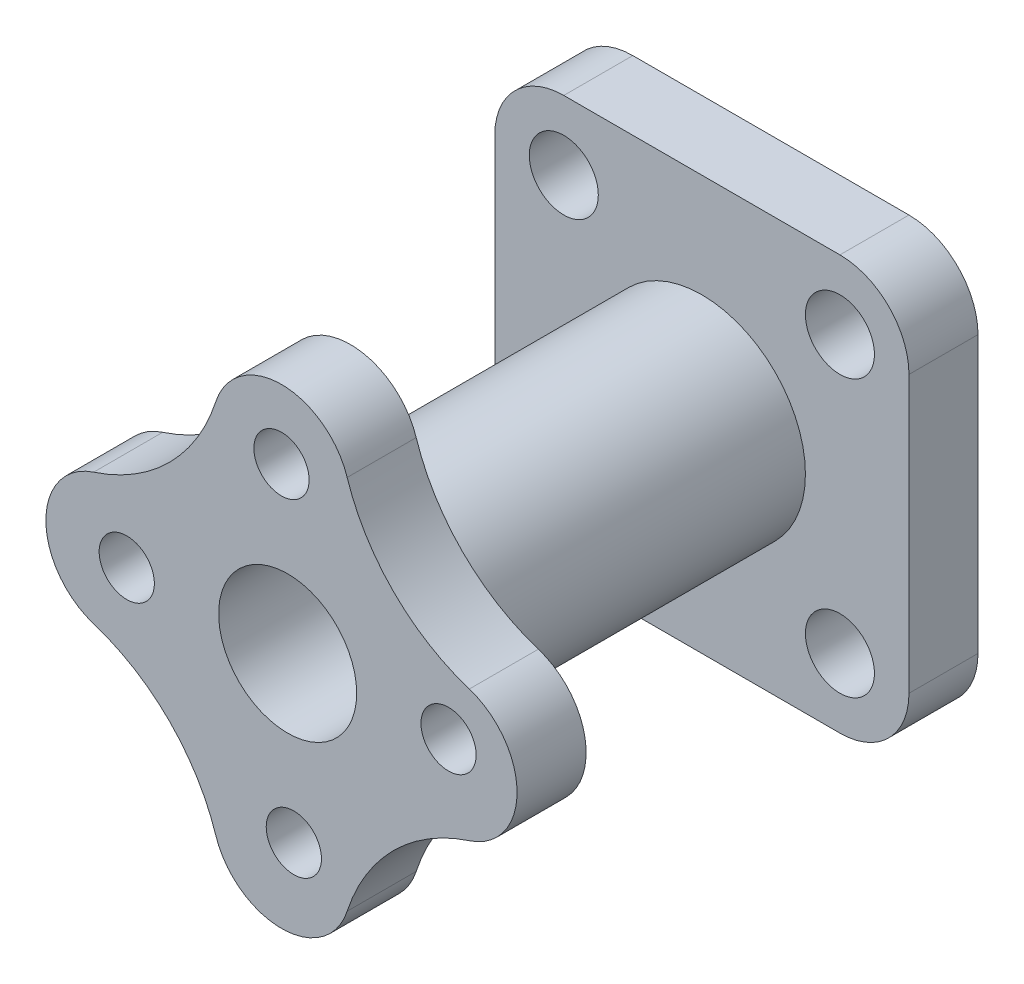
ISO-10303-21;
HEADER;
FILE_DESCRIPTION(('STEP AP214'),'2;1');
FILE_NAME('part.step','',(''),(''),'','','');
FILE_SCHEMA(('AUTOMOTIVE_DESIGN { 1 0 10303 214 1 1 1 1 }'));
ENDSEC;
DATA;
#1=APPLICATION_CONTEXT('core data for automotive mechanical design processes');
#2=APPLICATION_PROTOCOL_DEFINITION('international standard','automotive_design',2000,#1);
#3=PRODUCT_CONTEXT('',#1,'mechanical');
#4=PRODUCT('Part','Part','',(#3));
#5=PRODUCT_RELATED_PRODUCT_CATEGORY('part','',(#4));
#6=PRODUCT_DEFINITION_FORMATION('','',#4);
#7=PRODUCT_DEFINITION_CONTEXT('part definition',#1,'design');
#8=PRODUCT_DEFINITION('design','',#6,#7);
#9=PRODUCT_DEFINITION_SHAPE('','',#8);
#10=(LENGTH_UNIT() NAMED_UNIT(*) SI_UNIT(.MILLI.,.METRE.));
#11=(NAMED_UNIT(*) PLANE_ANGLE_UNIT() SI_UNIT($,.RADIAN.));
#12=(NAMED_UNIT(*) SI_UNIT($,.STERADIAN.) SOLID_ANGLE_UNIT());
#13=UNCERTAINTY_MEASURE_WITH_UNIT(LENGTH_MEASURE(1.E-05),#10,'distance_accuracy_value','');
#14=(GEOMETRIC_REPRESENTATION_CONTEXT(3) GLOBAL_UNCERTAINTY_ASSIGNED_CONTEXT((#13)) GLOBAL_UNIT_ASSIGNED_CONTEXT((#10,
#11,#12)) REPRESENTATION_CONTEXT('',''));
#15=CARTESIAN_POINT('',(0.,0.,0.));
#16=DIRECTION('',(0.,0.,1.));
#17=DIRECTION('',(1.,0.,0.));
#18=AXIS2_PLACEMENT_3D('',#15,#16,#17);
#19=CARTESIAN_POINT('',(-60.,60.,20.));
#20=DIRECTION('',(1.,0.,0.));
#21=DIRECTION('',(0.,1.,0.));
#22=AXIS2_PLACEMENT_3D('',#19,#20,#21);
#23=PLANE('',#22);
#24=DIRECTION('',(0.,-1.,0.));
#25=VECTOR('',#24,1.);
#26=CARTESIAN_POINT('',(-60.,60.,20.));
#27=LINE('',#26,#25);
#28=CARTESIAN_POINT('',(-60.,40.,20.));
#29=VERTEX_POINT('',#28);
#30=CARTESIAN_POINT('',(-60.,-40.,20.));
#31=VERTEX_POINT('',#30);
#32=EDGE_CURVE('E199',#29,#31,#27,.T.);
#33=ORIENTED_EDGE('',*,*,#32,.F.);
#34=DIRECTION('',(0.,0.,-1.));
#35=VECTOR('',#34,1.);
#36=CARTESIAN_POINT('',(-60.,40.,20.));
#37=LINE('',#36,#35);
#38=CARTESIAN_POINT('',(-60.,40.,0.));
#39=VERTEX_POINT('',#38);
#40=EDGE_CURVE('E11',#29,#39,#37,.T.);
#41=ORIENTED_EDGE('',*,*,#40,.T.);
#42=DIRECTION('',(0.,-1.,0.));
#43=VECTOR('',#42,1.);
#44=CARTESIAN_POINT('',(-60.,60.,0.));
#45=LINE('',#44,#43);
#46=CARTESIAN_POINT('',(-60.,-40.,0.));
#47=VERTEX_POINT('',#46);
#48=EDGE_CURVE('E197',#39,#47,#45,.T.);
#49=ORIENTED_EDGE('',*,*,#48,.T.);
#50=DIRECTION('',(0.,0.,-1.));
#51=VECTOR('',#50,1.);
#52=CARTESIAN_POINT('',(-60.,-40.,20.));
#53=LINE('',#52,#51);
#54=EDGE_CURVE('E48',#47,#31,#53,.F.);
#55=ORIENTED_EDGE('',*,*,#54,.T.);
#56=EDGE_LOOP('',(#33,#41,#49,#55));
#57=FACE_BOUND('',#56,.T.);
#58=ADVANCED_FACE('F39',(#57),#23,.F.);
#59=CARTESIAN_POINT('',(-60.,-60.,20.));
#60=DIRECTION('',(0.,1.,0.));
#61=DIRECTION('',(0.,0.,1.));
#62=AXIS2_PLACEMENT_3D('',#59,#60,#61);
#63=PLANE('',#62);
#64=DIRECTION('',(1.,0.,0.));
#65=VECTOR('',#64,1.);
#66=CARTESIAN_POINT('',(-60.,-60.,0.));
#67=LINE('',#66,#65);
#68=CARTESIAN_POINT('',(-40.,-60.,0.));
#69=VERTEX_POINT('',#68);
#70=CARTESIAN_POINT('',(40.,-60.,0.));
#71=VERTEX_POINT('',#70);
#72=EDGE_CURVE('E218',#69,#71,#67,.T.);
#73=ORIENTED_EDGE('',*,*,#72,.T.);
#74=DIRECTION('',(0.,0.,-1.));
#75=VECTOR('',#74,1.);
#76=CARTESIAN_POINT('',(40.,-60.,20.));
#77=LINE('',#76,#75);
#78=CARTESIAN_POINT('',(40.,-60.,20.));
#79=VERTEX_POINT('',#78);
#80=EDGE_CURVE('E55',#71,#79,#77,.F.);
#81=ORIENTED_EDGE('',*,*,#80,.T.);
#82=DIRECTION('',(1.,0.,0.));
#83=VECTOR('',#82,1.);
#84=CARTESIAN_POINT('',(-60.,-60.,20.));
#85=LINE('',#84,#83);
#86=CARTESIAN_POINT('',(-40.,-60.,20.));
#87=VERTEX_POINT('',#86);
#88=EDGE_CURVE('E202',#87,#79,#85,.T.);
#89=ORIENTED_EDGE('',*,*,#88,.F.);
#90=DIRECTION('',(0.,0.,-1.));
#91=VECTOR('',#90,1.);
#92=CARTESIAN_POINT('',(-40.,-60.,20.));
#93=LINE('',#92,#91);
#94=EDGE_CURVE('E268',#87,#69,#93,.T.);
#95=ORIENTED_EDGE('',*,*,#94,.T.);
#96=EDGE_LOOP('',(#73,#81,#89,#95));
#97=FACE_BOUND('',#96,.T.);
#98=ADVANCED_FACE('F284',(#97),#63,.F.);
#99=CARTESIAN_POINT('',(60.,60.,20.));
#100=DIRECTION('',(-1.,0.,0.));
#101=DIRECTION('',(0.,-1.,0.));
#102=AXIS2_PLACEMENT_3D('',#99,#100,#101);
#103=PLANE('',#102);
#104=DIRECTION('',(0.,1.,0.));
#105=VECTOR('',#104,1.);
#106=CARTESIAN_POINT('',(60.,60.,0.));
#107=LINE('',#106,#105);
#108=CARTESIAN_POINT('',(60.,-40.,0.));
#109=VERTEX_POINT('',#108);
#110=CARTESIAN_POINT('',(60.,40.,0.));
#111=VERTEX_POINT('',#110);
#112=EDGE_CURVE('E221',#109,#111,#107,.T.);
#113=ORIENTED_EDGE('',*,*,#112,.T.);
#114=DIRECTION('',(0.,0.,-1.));
#115=VECTOR('',#114,1.);
#116=CARTESIAN_POINT('',(60.,40.,20.));
#117=LINE('',#116,#115);
#118=CARTESIAN_POINT('',(60.,40.,20.));
#119=VERTEX_POINT('',#118);
#120=EDGE_CURVE('E254',#111,#119,#117,.F.);
#121=ORIENTED_EDGE('',*,*,#120,.T.);
#122=DIRECTION('',(0.,1.,0.));
#123=VECTOR('',#122,1.);
#124=CARTESIAN_POINT('',(60.,60.,20.));
#125=LINE('',#124,#123);
#126=CARTESIAN_POINT('',(60.,-40.,20.));
#127=VERTEX_POINT('',#126);
#128=EDGE_CURVE('E206',#127,#119,#125,.T.);
#129=ORIENTED_EDGE('',*,*,#128,.F.);
#130=DIRECTION('',(0.,0.,-1.));
#131=VECTOR('',#130,1.);
#132=CARTESIAN_POINT('',(60.,-40.,20.));
#133=LINE('',#132,#131);
#134=EDGE_CURVE('E250',#127,#109,#133,.T.);
#135=ORIENTED_EDGE('',*,*,#134,.T.);
#136=EDGE_LOOP('',(#113,#121,#129,#135));
#137=FACE_BOUND('',#136,.T.);
#138=ADVANCED_FACE('F295',(#137),#103,.F.);
#139=CARTESIAN_POINT('',(-60.,60.,20.));
#140=DIRECTION('',(0.,-1.,0.));
#141=DIRECTION('',(0.,0.,-1.));
#142=AXIS2_PLACEMENT_3D('',#139,#140,#141);
#143=PLANE('',#142);
#144=DIRECTION('',(-1.,0.,0.));
#145=VECTOR('',#144,1.);
#146=CARTESIAN_POINT('',(-60.,60.,20.));
#147=LINE('',#146,#145);
#148=CARTESIAN_POINT('',(40.,60.,20.));
#149=VERTEX_POINT('',#148);
#150=CARTESIAN_POINT('',(-40.,60.,20.));
#151=VERTEX_POINT('',#150);
#152=EDGE_CURVE('E210',#149,#151,#147,.T.);
#153=ORIENTED_EDGE('',*,*,#152,.F.);
#154=DIRECTION('',(0.,0.,-1.));
#155=VECTOR('',#154,1.);
#156=CARTESIAN_POINT('',(40.,60.,20.));
#157=LINE('',#156,#155);
#158=CARTESIAN_POINT('',(40.,60.,0.));
#159=VERTEX_POINT('',#158);
#160=EDGE_CURVE('E234',#149,#159,#157,.T.);
#161=ORIENTED_EDGE('',*,*,#160,.T.);
#162=DIRECTION('',(-1.,0.,0.));
#163=VECTOR('',#162,1.);
#164=CARTESIAN_POINT('',(-60.,60.,0.));
#165=LINE('',#164,#163);
#166=CARTESIAN_POINT('',(-40.,60.,0.));
#167=VERTEX_POINT('',#166);
#168=EDGE_CURVE('E203',#159,#167,#165,.T.);
#169=ORIENTED_EDGE('',*,*,#168,.T.);
#170=DIRECTION('',(0.,0.,-1.));
#171=VECTOR('',#170,1.);
#172=CARTESIAN_POINT('',(-40.,60.,20.));
#173=LINE('',#172,#171);
#174=EDGE_CURVE('E231',#167,#151,#173,.F.);
#175=ORIENTED_EDGE('',*,*,#174,.T.);
#176=EDGE_LOOP('',(#153,#161,#169,#175));
#177=FACE_BOUND('',#176,.T.);
#178=ADVANCED_FACE('F303',(#177),#143,.F.);
#179=CARTESIAN_POINT('',(0.,0.,20.));
#180=DIRECTION('',(0.,0.,1.));
#181=DIRECTION('',(1.,0.,0.));
#182=AXIS2_PLACEMENT_3D('',#179,#180,#181);
#183=PLANE('',#182);
#184=CARTESIAN_POINT('',(-40.0000000000001,39.9999999999998,20.));
#185=DIRECTION('',(0.,0.,1.));
#186=DIRECTION('',(1.,0.,0.));
#187=AXIS2_PLACEMENT_3D('',#184,#185,#186);
#188=CIRCLE('',#187,10.);
#189=CARTESIAN_POINT('',(-30.0000000000001,39.9999999999998,20.));
#190=VERTEX_POINT('',#189);
#191=EDGE_CURVE('E583',#190,#190,#188,.F.);
#192=ORIENTED_EDGE('',*,*,#191,.T.);
#193=EDGE_LOOP('',(#192));
#194=FACE_BOUND('',#193,.T.);
#195=CARTESIAN_POINT('',(-40.,-40.,20.));
#196=DIRECTION('',(0.,0.,1.));
#197=DIRECTION('',(1.,0.,0.));
#198=AXIS2_PLACEMENT_3D('',#195,#196,#197);
#199=CIRCLE('',#198,10.);
#200=CARTESIAN_POINT('',(-30.,-40.,20.));
#201=VERTEX_POINT('',#200);
#202=EDGE_CURVE('E598',#201,#201,#199,.F.);
#203=ORIENTED_EDGE('',*,*,#202,.T.);
#204=EDGE_LOOP('',(#203));
#205=FACE_BOUND('',#204,.T.);
#206=CARTESIAN_POINT('',(40.0000000000004,-39.9999999999996,20.));
#207=DIRECTION('',(0.,0.,1.));
#208=DIRECTION('',(1.,0.,0.));
#209=AXIS2_PLACEMENT_3D('',#206,#207,#208);
#210=CIRCLE('',#209,10.);
#211=CARTESIAN_POINT('',(50.0000000000004,-39.9999999999996,20.));
#212=VERTEX_POINT('',#211);
#213=EDGE_CURVE('E609',#212,#212,#210,.F.);
#214=ORIENTED_EDGE('',*,*,#213,.T.);
#215=EDGE_LOOP('',(#214));
#216=FACE_BOUND('',#215,.T.);
#217=CARTESIAN_POINT('',(40.,40.,20.));
#218=DIRECTION('',(0.,0.,1.));
#219=DIRECTION('',(1.,0.,0.));
#220=AXIS2_PLACEMENT_3D('',#217,#218,#219);
#221=CIRCLE('',#220,10.);
#222=CARTESIAN_POINT('',(50.,40.,20.));
#223=VERTEX_POINT('',#222);
#224=EDGE_CURVE('E622',#223,#223,#221,.F.);
#225=ORIENTED_EDGE('',*,*,#224,.T.);
#226=EDGE_LOOP('',(#225));
#227=FACE_BOUND('',#226,.T.);
#228=CARTESIAN_POINT('',(0.,0.,20.));
#229=DIRECTION('',(0.,0.,1.));
#230=DIRECTION('',(1.,0.,0.));
#231=AXIS2_PLACEMENT_3D('',#228,#229,#230);
#232=CIRCLE('',#231,30.);
#233=CARTESIAN_POINT('',(30.,0.,20.));
#234=VERTEX_POINT('',#233);
#235=EDGE_CURVE('E184',#234,#234,#232,.T.);
#236=ORIENTED_EDGE('',*,*,#235,.F.);
#237=EDGE_LOOP('',(#236));
#238=FACE_BOUND('',#237,.T.);
#239=ORIENTED_EDGE('',*,*,#128,.T.);
#240=CARTESIAN_POINT('',(40.,40.,20.));
#241=DIRECTION('',(0.,0.,1.));
#242=DIRECTION('',(1.,0.,0.));
#243=AXIS2_PLACEMENT_3D('',#240,#241,#242);
#244=CIRCLE('',#243,20.);
#245=EDGE_CURVE('E265',#119,#149,#244,.T.);
#246=ORIENTED_EDGE('',*,*,#245,.T.);
#247=ORIENTED_EDGE('',*,*,#152,.T.);
#248=CARTESIAN_POINT('',(-40.,40.,20.));
#249=DIRECTION('',(0.,0.,1.));
#250=DIRECTION('',(1.,0.,0.));
#251=AXIS2_PLACEMENT_3D('',#248,#249,#250);
#252=CIRCLE('',#251,20.);
#253=EDGE_CURVE('E259',#151,#29,#252,.T.);
#254=ORIENTED_EDGE('',*,*,#253,.T.);
#255=ORIENTED_EDGE('',*,*,#32,.T.);
#256=CARTESIAN_POINT('',(-40.,-40.,20.));
#257=DIRECTION('',(0.,0.,1.));
#258=DIRECTION('',(1.,0.,0.));
#259=AXIS2_PLACEMENT_3D('',#256,#257,#258);
#260=CIRCLE('',#259,20.);
#261=EDGE_CURVE('E62',#31,#87,#260,.T.);
#262=ORIENTED_EDGE('',*,*,#261,.T.);
#263=ORIENTED_EDGE('',*,*,#88,.T.);
#264=CARTESIAN_POINT('',(40.,-40.,20.));
#265=DIRECTION('',(0.,0.,1.));
#266=DIRECTION('',(1.,0.,0.));
#267=AXIS2_PLACEMENT_3D('',#264,#265,#266);
#268=CIRCLE('',#267,20.);
#269=EDGE_CURVE('E262',#79,#127,#268,.T.);
#270=ORIENTED_EDGE('',*,*,#269,.T.);
#271=EDGE_LOOP('',(#239,#246,#247,#254,#255,#262,#263,#270));
#272=FACE_BOUND('',#271,.T.);
#273=ADVANCED_FACE('F280',(#194,#205,#216,#227,#238,#272),#183,.T.);
#274=CARTESIAN_POINT('',(0.,0.,0.));
#275=DIRECTION('',(0.,0.,1.));
#276=DIRECTION('',(1.,0.,0.));
#277=AXIS2_PLACEMENT_3D('',#274,#275,#276);
#278=PLANE('',#277);
#279=CARTESIAN_POINT('',(-40.0000000000001,39.9999999999998,0.));
#280=DIRECTION('',(0.,0.,-1.));
#281=DIRECTION('',(0.,-1.,0.));
#282=AXIS2_PLACEMENT_3D('',#279,#280,#281);
#283=CIRCLE('',#282,10.);
#284=CARTESIAN_POINT('',(-40.0000000000001,29.9999999999998,0.));
#285=VERTEX_POINT('',#284);
#286=EDGE_CURVE('E586',#285,#285,#283,.T.);
#287=ORIENTED_EDGE('',*,*,#286,.F.);
#288=EDGE_LOOP('',(#287));
#289=FACE_BOUND('',#288,.T.);
#290=CARTESIAN_POINT('',(-40.,-40.,0.));
#291=DIRECTION('',(0.,0.,-1.));
#292=DIRECTION('',(1.,0.,0.));
#293=AXIS2_PLACEMENT_3D('',#290,#291,#292);
#294=CIRCLE('',#293,10.);
#295=CARTESIAN_POINT('',(-30.,-40.,0.));
#296=VERTEX_POINT('',#295);
#297=EDGE_CURVE('E595',#296,#296,#294,.T.);
#298=ORIENTED_EDGE('',*,*,#297,.F.);
#299=EDGE_LOOP('',(#298));
#300=FACE_BOUND('',#299,.T.);
#301=CARTESIAN_POINT('',(40.0000000000004,-39.9999999999996,0.));
#302=DIRECTION('',(0.,0.,-1.));
#303=DIRECTION('',(0.,1.,0.));
#304=AXIS2_PLACEMENT_3D('',#301,#302,#303);
#305=CIRCLE('',#304,10.);
#306=CARTESIAN_POINT('',(40.0000000000003,-29.9999999999996,0.));
#307=VERTEX_POINT('',#306);
#308=EDGE_CURVE('E602',#307,#307,#305,.T.);
#309=ORIENTED_EDGE('',*,*,#308,.F.);
#310=EDGE_LOOP('',(#309));
#311=FACE_BOUND('',#310,.T.);
#312=CARTESIAN_POINT('',(40.,40.,0.));
#313=DIRECTION('',(0.,0.,-1.));
#314=DIRECTION('',(-1.,0.,0.));
#315=AXIS2_PLACEMENT_3D('',#312,#313,#314);
#316=CIRCLE('',#315,10.);
#317=CARTESIAN_POINT('',(30.,40.,0.));
#318=VERTEX_POINT('',#317);
#319=EDGE_CURVE('E633',#318,#318,#316,.T.);
#320=ORIENTED_EDGE('',*,*,#319,.F.);
#321=EDGE_LOOP('',(#320));
#322=FACE_BOUND('',#321,.T.);
#323=ORIENTED_EDGE('',*,*,#168,.F.);
#324=CARTESIAN_POINT('',(40.,40.,0.));
#325=DIRECTION('',(0.,0.,1.));
#326=DIRECTION('',(1.,0.,0.));
#327=AXIS2_PLACEMENT_3D('',#324,#325,#326);
#328=CIRCLE('',#327,20.);
#329=EDGE_CURVE('E247',#159,#111,#328,.F.);
#330=ORIENTED_EDGE('',*,*,#329,.T.);
#331=ORIENTED_EDGE('',*,*,#112,.F.);
#332=CARTESIAN_POINT('',(40.,-40.,0.));
#333=DIRECTION('',(0.,0.,1.));
#334=DIRECTION('',(1.,0.,0.));
#335=AXIS2_PLACEMENT_3D('',#332,#333,#334);
#336=CIRCLE('',#335,20.);
#337=EDGE_CURVE('E244',#109,#71,#336,.F.);
#338=ORIENTED_EDGE('',*,*,#337,.T.);
#339=ORIENTED_EDGE('',*,*,#72,.F.);
#340=CARTESIAN_POINT('',(-40.,-40.,0.));
#341=DIRECTION('',(0.,0.,1.));
#342=DIRECTION('',(1.,0.,0.));
#343=AXIS2_PLACEMENT_3D('',#340,#341,#342);
#344=CIRCLE('',#343,20.);
#345=EDGE_CURVE('E238',#69,#47,#344,.F.);
#346=ORIENTED_EDGE('',*,*,#345,.T.);
#347=ORIENTED_EDGE('',*,*,#48,.F.);
#348=CARTESIAN_POINT('',(-40.,40.,0.));
#349=DIRECTION('',(0.,0.,1.));
#350=DIRECTION('',(1.,0.,0.));
#351=AXIS2_PLACEMENT_3D('',#348,#349,#350);
#352=CIRCLE('',#351,20.);
#353=EDGE_CURVE('E241',#39,#167,#352,.F.);
#354=ORIENTED_EDGE('',*,*,#353,.T.);
#355=EDGE_LOOP('',(#323,#330,#331,#338,#339,#346,#347,#354));
#356=FACE_BOUND('',#355,.T.);
#357=ADVANCED_FACE('F287',(#289,#300,#311,#322,#356),#278,.F.);
#358=CARTESIAN_POINT('',(0.,0.,120.));
#359=DIRECTION('',(0.,0.,-1.));
#360=DIRECTION('',(-1.,0.,0.));
#361=AXIS2_PLACEMENT_3D('',#358,#359,#360);
#362=CYLINDRICAL_SURFACE('',#361,30.);
#363=CARTESIAN_POINT('',(0.,0.,120.));
#364=DIRECTION('',(0.,0.,1.));
#365=DIRECTION('',(1.,0.,0.));
#366=AXIS2_PLACEMENT_3D('',#363,#364,#365);
#367=CIRCLE('',#366,30.);
#368=CARTESIAN_POINT('',(30.,0.,120.));
#369=VERTEX_POINT('',#368);
#370=EDGE_CURVE('E189',#369,#369,#367,.T.);
#371=ORIENTED_EDGE('',*,*,#370,.F.);
#372=EDGE_LOOP('',(#371));
#373=FACE_BOUND('',#372,.T.);
#374=ORIENTED_EDGE('',*,*,#235,.T.);
#375=EDGE_LOOP('',(#374));
#376=FACE_BOUND('',#375,.T.);
#377=ADVANCED_FACE('F340',(#373,#376),#362,.T.);
#378=CARTESIAN_POINT('',(-37.4656068197629,58.1620697898916,140.));
#379=DIRECTION('',(0.,0.,1.));
#380=DIRECTION('',(1.,0.,0.));
#381=AXIS2_PLACEMENT_3D('',#378,#379,#380);
#382=PLANE('',#381);
#383=CARTESIAN_POINT('',(-46.6137077987234,-1.78808819358974,140.));
#384=DIRECTION('',(0.,0.,1.));
#385=DIRECTION('',(0.,1.,0.));
#386=AXIS2_PLACEMENT_3D('',#383,#384,#385);
#387=CIRCLE('',#386,8.);
#388=CARTESIAN_POINT('',(-46.6137077987234,6.21191180641026,140.));
#389=VERTEX_POINT('',#388);
#390=EDGE_CURVE('E617',#389,#389,#387,.T.);
#391=ORIENTED_EDGE('',*,*,#390,.F.);
#392=EDGE_LOOP('',(#391));
#393=FACE_BOUND('',#392,.T.);
#394=CARTESIAN_POINT('',(1.78808819358958,-46.6137077987234,140.));
#395=DIRECTION('',(0.,0.,1.));
#396=DIRECTION('',(-1.,0.,0.));
#397=AXIS2_PLACEMENT_3D('',#394,#395,#396);
#398=CIRCLE('',#397,8.);
#399=CARTESIAN_POINT('',(-6.21191180641042,-46.6137077987234,140.));
#400=VERTEX_POINT('',#399);
#401=EDGE_CURVE('E618',#400,#400,#398,.T.);
#402=ORIENTED_EDGE('',*,*,#401,.F.);
#403=EDGE_LOOP('',(#402));
#404=FACE_BOUND('',#403,.T.);
#405=CARTESIAN_POINT('',(46.6137077987233,1.78808819359006,140.));
#406=DIRECTION('',(0.,0.,1.));
#407=DIRECTION('',(0.,-1.,0.));
#408=AXIS2_PLACEMENT_3D('',#405,#406,#407);
#409=CIRCLE('',#408,8.);
#410=CARTESIAN_POINT('',(46.6137077987234,-6.21191180640994,140.));
#411=VERTEX_POINT('',#410);
#412=EDGE_CURVE('E593',#411,#411,#409,.T.);
#413=ORIENTED_EDGE('',*,*,#412,.F.);
#414=EDGE_LOOP('',(#413));
#415=FACE_BOUND('',#414,.T.);
#416=CARTESIAN_POINT('',(-1.78808819358958,46.6137077987234,140.));
#417=DIRECTION('',(0.,0.,1.));
#418=DIRECTION('',(1.,0.,0.));
#419=AXIS2_PLACEMENT_3D('',#416,#417,#418);
#420=CIRCLE('',#419,8.);
#421=CARTESIAN_POINT('',(6.21191180641042,46.6137077987234,140.));
#422=VERTEX_POINT('',#421);
#423=EDGE_CURVE('E644',#422,#422,#420,.T.);
#424=ORIENTED_EDGE('',*,*,#423,.F.);
#425=EDGE_LOOP('',(#424));
#426=FACE_BOUND('',#425,.T.);
#427=CARTESIAN_POINT('',(-1.78808819358958,46.6137077987234,140.));
#428=DIRECTION('',(0.,0.,1.));
#429=DIRECTION('',(1.,0.,0.));
#430=AXIS2_PLACEMENT_3D('',#427,#428,#429);
#431=CIRCLE('',#430,20.);
#432=CARTESIAN_POINT('',(17.2399217403692,52.772834194014,140.));
#433=VERTEX_POINT('',#432);
#434=CARTESIAN_POINT('',(-20.8160981275487,52.7728341940131,140.));
#435=VERTEX_POINT('',#434);
#436=EDGE_CURVE('E167',#433,#435,#431,.T.);
#437=ORIENTED_EDGE('',*,*,#436,.T.);
#438=CARTESIAN_POINT('',(-73.1431254459361,69.7104317810598,140.));
#439=DIRECTION('',(0.,0.,-1.));
#440=DIRECTION('',(1.,0.,0.));
#441=AXIS2_PLACEMENT_3D('',#438,#439,#440);
#442=CIRCLE('',#441,55.);
#443=CARTESIAN_POINT('',(-56.2055278588869,17.3834044626731,140.));
#444=VERTEX_POINT('',#443);
#445=EDGE_CURVE('E155',#435,#444,#442,.T.);
#446=ORIENTED_EDGE('',*,*,#445,.T.);
#447=CARTESIAN_POINT('',(-50.0464014635962,-1.64460547128564,140.));
#448=DIRECTION('',(0.,0.,1.));
#449=DIRECTION('',(1.,0.,0.));
#450=AXIS2_PLACEMENT_3D('',#447,#448,#449);
#451=CIRCLE('',#450,20.);
#452=CARTESIAN_POINT('',(-56.205527858886,-20.6726154052447,140.));
#453=VERTEX_POINT('',#452);
#454=EDGE_CURVE('E166',#444,#453,#451,.T.);
#455=ORIENTED_EDGE('',*,*,#454,.T.);
#456=CARTESIAN_POINT('',(-73.1431254459326,-72.9996427236322,140.));
#457=DIRECTION('',(0.,0.,-1.));
#458=DIRECTION('',(1.,0.,0.));
#459=AXIS2_PLACEMENT_3D('',#456,#457,#458);
#460=CIRCLE('',#459,55.);
#461=CARTESIAN_POINT('',(-20.816098127546,-56.062045136583,140.));
#462=VERTEX_POINT('',#461);
#463=EDGE_CURVE('E654',#453,#462,#460,.T.);
#464=ORIENTED_EDGE('',*,*,#463,.T.);
#465=CARTESIAN_POINT('',(-1.78808819358719,-49.9029187412923,140.));
#466=DIRECTION('',(0.,0.,1.));
#467=DIRECTION('',(1.,0.,0.));
#468=AXIS2_PLACEMENT_3D('',#465,#466,#467);
#469=CIRCLE('',#468,20.);
#470=CARTESIAN_POINT('',(17.2399217403719,-56.062045136582,140.));
#471=VERTEX_POINT('',#470);
#472=EDGE_CURVE('E657',#462,#471,#469,.T.);
#473=ORIENTED_EDGE('',*,*,#472,.T.);
#474=CARTESIAN_POINT('',(69.5669490587594,-72.9996427236287,140.));
#475=DIRECTION('',(0.,0.,-1.));
#476=DIRECTION('',(1.,0.,0.));
#477=AXIS2_PLACEMENT_3D('',#474,#475,#476);
#478=CIRCLE('',#477,55.);
#479=CARTESIAN_POINT('',(52.6293514717101,-20.6726154052421,140.));
#480=VERTEX_POINT('',#479);
#481=EDGE_CURVE('E660',#471,#480,#478,.T.);
#482=ORIENTED_EDGE('',*,*,#481,.T.);
#483=CARTESIAN_POINT('',(46.4702250764194,-1.6446054712833,140.));
#484=DIRECTION('',(0.,0.,1.));
#485=DIRECTION('',(1.,0.,0.));
#486=AXIS2_PLACEMENT_3D('',#483,#484,#485);
#487=CIRCLE('',#486,20.);
#488=CARTESIAN_POINT('',(52.6293514717091,17.3834044626758,140.));
#489=VERTEX_POINT('',#488);
#490=EDGE_CURVE('E663',#480,#489,#487,.T.);
#491=ORIENTED_EDGE('',*,*,#490,.T.);
#492=CARTESIAN_POINT('',(69.5669490587559,69.7104317810632,140.));
#493=DIRECTION('',(0.,0.,-1.));
#494=DIRECTION('',(1.,0.,0.));
#495=AXIS2_PLACEMENT_3D('',#492,#493,#494);
#496=CIRCLE('',#495,55.);
#497=EDGE_CURVE('E173',#489,#433,#496,.T.);
#498=ORIENTED_EDGE('',*,*,#497,.T.);
#499=EDGE_LOOP('',(#437,#446,#455,#464,#473,#482,#491,#498));
#500=FACE_BOUND('',#499,.T.);
#501=CARTESIAN_POINT('',(0.,0.,140.));
#502=DIRECTION('',(0.,0.,1.));
#503=DIRECTION('',(1.,0.,0.));
#504=AXIS2_PLACEMENT_3D('',#501,#502,#503);
#505=CIRCLE('',#504,20.);
#506=CARTESIAN_POINT('',(20.,0.,140.));
#507=VERTEX_POINT('',#506);
#508=EDGE_CURVE('E648',#507,#507,#505,.T.);
#509=ORIENTED_EDGE('',*,*,#508,.F.);
#510=EDGE_LOOP('',(#509));
#511=FACE_BOUND('',#510,.T.);
#512=ADVANCED_FACE('F170',(#393,#404,#415,#426,#500,#511),#382,.T.);
#513=CARTESIAN_POINT('',(-37.4656068197629,58.1620697898916,120.));
#514=DIRECTION('',(0.,0.,1.));
#515=DIRECTION('',(1.,0.,0.));
#516=AXIS2_PLACEMENT_3D('',#513,#514,#515);
#517=PLANE('',#516);
#518=CARTESIAN_POINT('',(-46.6137077987234,-1.78808819358974,120.));
#519=DIRECTION('',(0.,0.,1.));
#520=DIRECTION('',(1.,0.,0.));
#521=AXIS2_PLACEMENT_3D('',#518,#519,#520);
#522=CIRCLE('',#521,8.);
#523=CARTESIAN_POINT('',(-38.6137077987234,-1.78808819358974,120.));
#524=VERTEX_POINT('',#523);
#525=EDGE_CURVE('E613',#524,#524,#522,.F.);
#526=ORIENTED_EDGE('',*,*,#525,.F.);
#527=EDGE_LOOP('',(#526));
#528=FACE_BOUND('',#527,.T.);
#529=CARTESIAN_POINT('',(1.78808819358958,-46.6137077987234,120.));
#530=DIRECTION('',(0.,0.,1.));
#531=DIRECTION('',(1.,0.,0.));
#532=AXIS2_PLACEMENT_3D('',#529,#530,#531);
#533=CIRCLE('',#532,8.);
#534=CARTESIAN_POINT('',(9.78808819358957,-46.6137077987234,120.));
#535=VERTEX_POINT('',#534);
#536=EDGE_CURVE('E623',#535,#535,#533,.F.);
#537=ORIENTED_EDGE('',*,*,#536,.F.);
#538=EDGE_LOOP('',(#537));
#539=FACE_BOUND('',#538,.T.);
#540=CARTESIAN_POINT('',(46.6137077987233,1.78808819359006,120.));
#541=DIRECTION('',(0.,0.,1.));
#542=DIRECTION('',(1.,0.,0.));
#543=AXIS2_PLACEMENT_3D('',#540,#541,#542);
#544=CIRCLE('',#543,8.);
#545=CARTESIAN_POINT('',(54.6137077987233,1.78808819359006,120.));
#546=VERTEX_POINT('',#545);
#547=EDGE_CURVE('E588',#546,#546,#544,.F.);
#548=ORIENTED_EDGE('',*,*,#547,.F.);
#549=EDGE_LOOP('',(#548));
#550=FACE_BOUND('',#549,.T.);
#551=CARTESIAN_POINT('',(-1.78808819358958,46.6137077987234,120.));
#552=DIRECTION('',(0.,0.,1.));
#553=DIRECTION('',(1.,0.,0.));
#554=AXIS2_PLACEMENT_3D('',#551,#552,#553);
#555=CIRCLE('',#554,8.);
#556=CARTESIAN_POINT('',(6.21191180641042,46.6137077987234,120.));
#557=VERTEX_POINT('',#556);
#558=EDGE_CURVE('E637',#557,#557,#555,.F.);
#559=ORIENTED_EDGE('',*,*,#558,.F.);
#560=EDGE_LOOP('',(#559));
#561=FACE_BOUND('',#560,.T.);
#562=ORIENTED_EDGE('',*,*,#370,.T.);
#563=EDGE_LOOP('',(#562));
#564=FACE_BOUND('',#563,.T.);
#565=CARTESIAN_POINT('',(-1.78808819358958,46.6137077987234,120.));
#566=DIRECTION('',(0.,0.,1.));
#567=DIRECTION('',(1.,0.,0.));
#568=AXIS2_PLACEMENT_3D('',#565,#566,#567);
#569=CIRCLE('',#568,20.);
#570=CARTESIAN_POINT('',(17.2399217403692,52.772834194014,120.));
#571=VERTEX_POINT('',#570);
#572=CARTESIAN_POINT('',(-20.8160981275487,52.7728341940131,120.));
#573=VERTEX_POINT('',#572);
#574=EDGE_CURVE('E182',#571,#573,#569,.T.);
#575=ORIENTED_EDGE('',*,*,#574,.F.);
#576=CARTESIAN_POINT('',(69.5669490587559,69.7104317810632,120.));
#577=DIRECTION('',(0.,0.,-1.));
#578=DIRECTION('',(1.,0.,0.));
#579=AXIS2_PLACEMENT_3D('',#576,#577,#578);
#580=CIRCLE('',#579,55.);
#581=CARTESIAN_POINT('',(52.6293514717091,17.3834044626758,120.));
#582=VERTEX_POINT('',#581);
#583=EDGE_CURVE('E178',#582,#571,#580,.T.);
#584=ORIENTED_EDGE('',*,*,#583,.F.);
#585=CARTESIAN_POINT('',(46.4702250764194,-1.6446054712833,120.));
#586=DIRECTION('',(0.,0.,1.));
#587=DIRECTION('',(1.,0.,0.));
#588=AXIS2_PLACEMENT_3D('',#585,#586,#587);
#589=CIRCLE('',#588,20.);
#590=CARTESIAN_POINT('',(52.6293514717101,-20.6726154052421,120.));
#591=VERTEX_POINT('',#590);
#592=EDGE_CURVE('E686',#591,#582,#589,.T.);
#593=ORIENTED_EDGE('',*,*,#592,.F.);
#594=CARTESIAN_POINT('',(69.5669490587594,-72.9996427236287,120.));
#595=DIRECTION('',(0.,0.,-1.));
#596=DIRECTION('',(1.,0.,0.));
#597=AXIS2_PLACEMENT_3D('',#594,#595,#596);
#598=CIRCLE('',#597,55.);
#599=CARTESIAN_POINT('',(17.2399217403719,-56.062045136582,120.));
#600=VERTEX_POINT('',#599);
#601=EDGE_CURVE('E683',#600,#591,#598,.T.);
#602=ORIENTED_EDGE('',*,*,#601,.F.);
#603=CARTESIAN_POINT('',(-1.78808819358719,-49.9029187412923,120.));
#604=DIRECTION('',(0.,0.,1.));
#605=DIRECTION('',(1.,0.,0.));
#606=AXIS2_PLACEMENT_3D('',#603,#604,#605);
#607=CIRCLE('',#606,20.);
#608=CARTESIAN_POINT('',(-20.816098127546,-56.062045136583,120.));
#609=VERTEX_POINT('',#608);
#610=EDGE_CURVE('E680',#609,#600,#607,.T.);
#611=ORIENTED_EDGE('',*,*,#610,.F.);
#612=CARTESIAN_POINT('',(-73.1431254459326,-72.9996427236322,120.));
#613=DIRECTION('',(0.,0.,-1.));
#614=DIRECTION('',(1.,0.,0.));
#615=AXIS2_PLACEMENT_3D('',#612,#613,#614);
#616=CIRCLE('',#615,55.);
#617=CARTESIAN_POINT('',(-56.205527858886,-20.6726154052447,120.));
#618=VERTEX_POINT('',#617);
#619=EDGE_CURVE('E677',#618,#609,#616,.T.);
#620=ORIENTED_EDGE('',*,*,#619,.F.);
#621=CARTESIAN_POINT('',(-50.0464014635962,-1.64460547128564,120.));
#622=DIRECTION('',(0.,0.,1.));
#623=DIRECTION('',(1.,0.,0.));
#624=AXIS2_PLACEMENT_3D('',#621,#622,#623);
#625=CIRCLE('',#624,20.);
#626=CARTESIAN_POINT('',(-56.2055278588869,17.3834044626731,120.));
#627=VERTEX_POINT('',#626);
#628=EDGE_CURVE('E674',#627,#618,#625,.T.);
#629=ORIENTED_EDGE('',*,*,#628,.F.);
#630=CARTESIAN_POINT('',(-73.1431254459361,69.7104317810598,120.));
#631=DIRECTION('',(0.,0.,-1.));
#632=DIRECTION('',(1.,0.,0.));
#633=AXIS2_PLACEMENT_3D('',#630,#631,#632);
#634=CIRCLE('',#633,55.);
#635=EDGE_CURVE('E671',#573,#627,#634,.T.);
#636=ORIENTED_EDGE('',*,*,#635,.F.);
#637=EDGE_LOOP('',(#575,#584,#593,#602,#611,#620,#629,#636));
#638=FACE_BOUND('',#637,.T.);
#639=ADVANCED_FACE('F379',(#528,#539,#550,#561,#564,#638),#517,.F.);
#640=CARTESIAN_POINT('',(-1.78808819358958,46.6137077987234,140.));
#641=DIRECTION('',(0.,0.,-1.));
#642=DIRECTION('',(-1.,0.,0.));
#643=AXIS2_PLACEMENT_3D('',#640,#641,#642);
#644=CYLINDRICAL_SURFACE('',#643,20.);
#645=ORIENTED_EDGE('',*,*,#574,.T.);
#646=DIRECTION('',(0.,0.,-1.));
#647=VECTOR('',#646,1.);
#648=CARTESIAN_POINT('',(-20.8160981275487,52.7728341940131,140.));
#649=LINE('',#648,#647);
#650=EDGE_CURVE('E159',#435,#573,#649,.T.);
#651=ORIENTED_EDGE('',*,*,#650,.F.);
#652=ORIENTED_EDGE('',*,*,#436,.F.);
#653=DIRECTION('',(0.,0.,-1.));
#654=VECTOR('',#653,1.);
#655=CARTESIAN_POINT('',(17.2399217403692,52.772834194014,140.));
#656=LINE('',#655,#654);
#657=EDGE_CURVE('E668',#433,#571,#656,.T.);
#658=ORIENTED_EDGE('',*,*,#657,.T.);
#659=EDGE_LOOP('',(#645,#651,#652,#658));
#660=FACE_BOUND('',#659,.T.);
#661=ADVANCED_FACE('F180',(#660),#644,.T.);
#662=CARTESIAN_POINT('',(-73.1431254459361,69.7104317810598,140.));
#663=DIRECTION('',(0.,0.,-1.));
#664=DIRECTION('',(-1.,0.,0.));
#665=AXIS2_PLACEMENT_3D('',#662,#663,#664);
#666=CYLINDRICAL_SURFACE('',#665,55.);
#667=ORIENTED_EDGE('',*,*,#635,.T.);
#668=DIRECTION('',(0.,0.,-1.));
#669=VECTOR('',#668,1.);
#670=CARTESIAN_POINT('',(-56.2055278588869,17.3834044626731,140.));
#671=LINE('',#670,#669);
#672=EDGE_CURVE('E162',#444,#627,#671,.T.);
#673=ORIENTED_EDGE('',*,*,#672,.F.);
#674=ORIENTED_EDGE('',*,*,#445,.F.);
#675=ORIENTED_EDGE('',*,*,#650,.T.);
#676=EDGE_LOOP('',(#667,#673,#674,#675));
#677=FACE_BOUND('',#676,.T.);
#678=ADVANCED_FACE('F157',(#677),#666,.F.);
#679=CARTESIAN_POINT('',(-50.0464014635962,-1.64460547128564,140.));
#680=DIRECTION('',(0.,0.,-1.));
#681=DIRECTION('',(-1.,0.,0.));
#682=AXIS2_PLACEMENT_3D('',#679,#680,#681);
#683=CYLINDRICAL_SURFACE('',#682,20.);
#684=ORIENTED_EDGE('',*,*,#628,.T.);
#685=DIRECTION('',(0.,0.,-1.));
#686=VECTOR('',#685,1.);
#687=CARTESIAN_POINT('',(-56.205527858886,-20.6726154052447,140.));
#688=LINE('',#687,#686);
#689=EDGE_CURVE('E191',#453,#618,#688,.T.);
#690=ORIENTED_EDGE('',*,*,#689,.F.);
#691=ORIENTED_EDGE('',*,*,#454,.F.);
#692=ORIENTED_EDGE('',*,*,#672,.T.);
#693=EDGE_LOOP('',(#684,#690,#691,#692));
#694=FACE_BOUND('',#693,.T.);
#695=ADVANCED_FACE('F400',(#694),#683,.T.);
#696=CARTESIAN_POINT('',(-73.1431254459326,-72.9996427236322,140.));
#697=DIRECTION('',(0.,0.,-1.));
#698=DIRECTION('',(-1.,0.,0.));
#699=AXIS2_PLACEMENT_3D('',#696,#697,#698);
#700=CYLINDRICAL_SURFACE('',#699,55.);
#701=ORIENTED_EDGE('',*,*,#619,.T.);
#702=DIRECTION('',(0.,0.,-1.));
#703=VECTOR('',#702,1.);
#704=CARTESIAN_POINT('',(-20.816098127546,-56.062045136583,140.));
#705=LINE('',#704,#703);
#706=EDGE_CURVE('E705',#462,#609,#705,.T.);
#707=ORIENTED_EDGE('',*,*,#706,.F.);
#708=ORIENTED_EDGE('',*,*,#463,.F.);
#709=ORIENTED_EDGE('',*,*,#689,.T.);
#710=EDGE_LOOP('',(#701,#707,#708,#709));
#711=FACE_BOUND('',#710,.T.);
#712=ADVANCED_FACE('F406',(#711),#700,.F.);
#713=CARTESIAN_POINT('',(-1.78808819358719,-49.9029187412923,140.));
#714=DIRECTION('',(0.,0.,-1.));
#715=DIRECTION('',(-1.,0.,0.));
#716=AXIS2_PLACEMENT_3D('',#713,#714,#715);
#717=CYLINDRICAL_SURFACE('',#716,20.);
#718=ORIENTED_EDGE('',*,*,#610,.T.);
#719=DIRECTION('',(0.,0.,-1.));
#720=VECTOR('',#719,1.);
#721=CARTESIAN_POINT('',(17.2399217403719,-56.062045136582,140.));
#722=LINE('',#721,#720);
#723=EDGE_CURVE('E701',#471,#600,#722,.T.);
#724=ORIENTED_EDGE('',*,*,#723,.F.);
#725=ORIENTED_EDGE('',*,*,#472,.F.);
#726=ORIENTED_EDGE('',*,*,#706,.T.);
#727=EDGE_LOOP('',(#718,#724,#725,#726));
#728=FACE_BOUND('',#727,.T.);
#729=ADVANCED_FACE('F414',(#728),#717,.T.);
#730=CARTESIAN_POINT('',(69.5669490587594,-72.9996427236287,140.));
#731=DIRECTION('',(0.,0.,-1.));
#732=DIRECTION('',(-1.,0.,0.));
#733=AXIS2_PLACEMENT_3D('',#730,#731,#732);
#734=CYLINDRICAL_SURFACE('',#733,55.);
#735=ORIENTED_EDGE('',*,*,#601,.T.);
#736=DIRECTION('',(0.,0.,-1.));
#737=VECTOR('',#736,1.);
#738=CARTESIAN_POINT('',(52.6293514717101,-20.6726154052421,140.));
#739=LINE('',#738,#737);
#740=EDGE_CURVE('E697',#480,#591,#739,.T.);
#741=ORIENTED_EDGE('',*,*,#740,.F.);
#742=ORIENTED_EDGE('',*,*,#481,.F.);
#743=ORIENTED_EDGE('',*,*,#723,.T.);
#744=EDGE_LOOP('',(#735,#741,#742,#743));
#745=FACE_BOUND('',#744,.T.);
#746=ADVANCED_FACE('F422',(#745),#734,.F.);
#747=CARTESIAN_POINT('',(46.4702250764194,-1.6446054712833,140.));
#748=DIRECTION('',(0.,0.,-1.));
#749=DIRECTION('',(-1.,0.,0.));
#750=AXIS2_PLACEMENT_3D('',#747,#748,#749);
#751=CYLINDRICAL_SURFACE('',#750,20.);
#752=ORIENTED_EDGE('',*,*,#592,.T.);
#753=DIRECTION('',(0.,0.,-1.));
#754=VECTOR('',#753,1.);
#755=CARTESIAN_POINT('',(52.6293514717091,17.3834044626758,140.));
#756=LINE('',#755,#754);
#757=EDGE_CURVE('E693',#489,#582,#756,.T.);
#758=ORIENTED_EDGE('',*,*,#757,.F.);
#759=ORIENTED_EDGE('',*,*,#490,.F.);
#760=ORIENTED_EDGE('',*,*,#740,.T.);
#761=EDGE_LOOP('',(#752,#758,#759,#760));
#762=FACE_BOUND('',#761,.T.);
#763=ADVANCED_FACE('F430',(#762),#751,.T.);
#764=CARTESIAN_POINT('',(69.5669490587559,69.7104317810632,140.));
#765=DIRECTION('',(0.,0.,-1.));
#766=DIRECTION('',(-1.,0.,0.));
#767=AXIS2_PLACEMENT_3D('',#764,#765,#766);
#768=CYLINDRICAL_SURFACE('',#767,55.);
#769=ORIENTED_EDGE('',*,*,#583,.T.);
#770=ORIENTED_EDGE('',*,*,#657,.F.);
#771=ORIENTED_EDGE('',*,*,#497,.F.);
#772=ORIENTED_EDGE('',*,*,#757,.T.);
#773=EDGE_LOOP('',(#769,#770,#771,#772));
#774=FACE_BOUND('',#773,.T.);
#775=ADVANCED_FACE('F333',(#774),#768,.F.);
#776=CARTESIAN_POINT('',(0.,0.,20.));
#777=DIRECTION('',(0.,0.,1.));
#778=DIRECTION('',(1.,0.,0.));
#779=AXIS2_PLACEMENT_3D('',#776,#777,#778);
#780=CIRCLE('',#779,20.);
#781=CARTESIAN_POINT('',(20.,0.,20.));
#782=VERTEX_POINT('',#781);
#783=EDGE_CURVE('E214',#782,#782,#780,.F.);
#784=ORIENTED_EDGE('',*,*,#783,.F.);
#785=EDGE_LOOP('',(#784));
#786=FACE_BOUND('',#785,.T.);
#787=ADVANCED_FACE('F327',(#786),#183,.T.);
#788=CARTESIAN_POINT('',(0.,0.,120.));
#789=DIRECTION('',(0.,0.,-1.));
#790=DIRECTION('',(-1.,0.,0.));
#791=AXIS2_PLACEMENT_3D('',#788,#789,#790);
#792=CYLINDRICAL_SURFACE('',#791,20.);
#793=ORIENTED_EDGE('',*,*,#783,.T.);
#794=EDGE_LOOP('',(#793));
#795=FACE_BOUND('',#794,.T.);
#796=ORIENTED_EDGE('',*,*,#508,.T.);
#797=EDGE_LOOP('',(#796));
#798=FACE_BOUND('',#797,.T.);
#799=ADVANCED_FACE('F323',(#795,#798),#792,.F.);
#800=CARTESIAN_POINT('',(40.,40.,20.));
#801=DIRECTION('',(0.,0.,-1.));
#802=DIRECTION('',(-1.,0.,0.));
#803=AXIS2_PLACEMENT_3D('',#800,#801,#802);
#804=CYLINDRICAL_SURFACE('',#803,20.);
#805=ORIENTED_EDGE('',*,*,#245,.F.);
#806=ORIENTED_EDGE('',*,*,#120,.F.);
#807=ORIENTED_EDGE('',*,*,#329,.F.);
#808=ORIENTED_EDGE('',*,*,#160,.F.);
#809=EDGE_LOOP('',(#805,#806,#807,#808));
#810=FACE_BOUND('',#809,.T.);
#811=ADVANCED_FACE('F301',(#810),#804,.T.);
#812=CARTESIAN_POINT('',(40.,-40.,20.));
#813=DIRECTION('',(0.,0.,-1.));
#814=DIRECTION('',(-1.,0.,0.));
#815=AXIS2_PLACEMENT_3D('',#812,#813,#814);
#816=CYLINDRICAL_SURFACE('',#815,20.);
#817=ORIENTED_EDGE('',*,*,#269,.F.);
#818=ORIENTED_EDGE('',*,*,#80,.F.);
#819=ORIENTED_EDGE('',*,*,#337,.F.);
#820=ORIENTED_EDGE('',*,*,#134,.F.);
#821=EDGE_LOOP('',(#817,#818,#819,#820));
#822=FACE_BOUND('',#821,.T.);
#823=ADVANCED_FACE('F292',(#822),#816,.T.);
#824=CARTESIAN_POINT('',(-40.,40.,20.));
#825=DIRECTION('',(0.,0.,-1.));
#826=DIRECTION('',(-1.,0.,0.));
#827=AXIS2_PLACEMENT_3D('',#824,#825,#826);
#828=CYLINDRICAL_SURFACE('',#827,20.);
#829=ORIENTED_EDGE('',*,*,#253,.F.);
#830=ORIENTED_EDGE('',*,*,#174,.F.);
#831=ORIENTED_EDGE('',*,*,#353,.F.);
#832=ORIENTED_EDGE('',*,*,#40,.F.);
#833=EDGE_LOOP('',(#829,#830,#831,#832));
#834=FACE_BOUND('',#833,.T.);
#835=ADVANCED_FACE('F306',(#834),#828,.T.);
#836=CARTESIAN_POINT('',(-40.,-40.,20.));
#837=DIRECTION('',(0.,0.,-1.));
#838=DIRECTION('',(-1.,0.,0.));
#839=AXIS2_PLACEMENT_3D('',#836,#837,#838);
#840=CYLINDRICAL_SURFACE('',#839,20.);
#841=ORIENTED_EDGE('',*,*,#261,.F.);
#842=ORIENTED_EDGE('',*,*,#54,.F.);
#843=ORIENTED_EDGE('',*,*,#345,.F.);
#844=ORIENTED_EDGE('',*,*,#94,.F.);
#845=EDGE_LOOP('',(#841,#842,#843,#844));
#846=FACE_BOUND('',#845,.T.);
#847=ADVANCED_FACE('F41',(#846),#840,.T.);
#848=CARTESIAN_POINT('',(-1.78808819358958,46.6137077987234,-0.001000000000001));
#849=DIRECTION('',(0.,0.,1.));
#850=DIRECTION('',(1.,0.,0.));
#851=AXIS2_PLACEMENT_3D('',#848,#849,#850);
#852=CYLINDRICAL_SURFACE('',#851,8.);
#853=ORIENTED_EDGE('',*,*,#423,.T.);
#854=EDGE_LOOP('',(#853));
#855=FACE_BOUND('',#854,.T.);
#856=ORIENTED_EDGE('',*,*,#558,.T.);
#857=EDGE_LOOP('',(#856));
#858=FACE_BOUND('',#857,.T.);
#859=ADVANCED_FACE('F312',(#855,#858),#852,.F.);
#860=CARTESIAN_POINT('',(40.,40.,140.001));
#861=DIRECTION('',(0.,0.,-1.));
#862=DIRECTION('',(-1.,0.,0.));
#863=AXIS2_PLACEMENT_3D('',#860,#861,#862);
#864=CYLINDRICAL_SURFACE('',#863,10.);
#865=ORIENTED_EDGE('',*,*,#224,.F.);
#866=EDGE_LOOP('',(#865));
#867=FACE_BOUND('',#866,.T.);
#868=ORIENTED_EDGE('',*,*,#319,.T.);
#869=EDGE_LOOP('',(#868));
#870=FACE_BOUND('',#869,.T.);
#871=ADVANCED_FACE('F508',(#867,#870),#864,.F.);
#872=CARTESIAN_POINT('',(46.6137077987233,1.78808819359006,-0.001000000000001));
#873=DIRECTION('',(0.,0.,1.));
#874=DIRECTION('',(1.,0.,0.));
#875=AXIS2_PLACEMENT_3D('',#872,#873,#874);
#876=CYLINDRICAL_SURFACE('',#875,8.);
#877=ORIENTED_EDGE('',*,*,#412,.T.);
#878=EDGE_LOOP('',(#877));
#879=FACE_BOUND('',#878,.T.);
#880=ORIENTED_EDGE('',*,*,#547,.T.);
#881=EDGE_LOOP('',(#880));
#882=FACE_BOUND('',#881,.T.);
#883=ADVANCED_FACE('F516',(#879,#882),#876,.F.);
#884=CARTESIAN_POINT('',(1.78808819358958,-46.6137077987234,-0.001000000000001));
#885=DIRECTION('',(0.,0.,1.));
#886=DIRECTION('',(1.,0.,0.));
#887=AXIS2_PLACEMENT_3D('',#884,#885,#886);
#888=CYLINDRICAL_SURFACE('',#887,8.);
#889=ORIENTED_EDGE('',*,*,#401,.T.);
#890=EDGE_LOOP('',(#889));
#891=FACE_BOUND('',#890,.T.);
#892=ORIENTED_EDGE('',*,*,#536,.T.);
#893=EDGE_LOOP('',(#892));
#894=FACE_BOUND('',#893,.T.);
#895=ADVANCED_FACE('F524',(#891,#894),#888,.F.);
#896=CARTESIAN_POINT('',(-46.6137077987234,-1.78808819358974,-0.001000000000001));
#897=DIRECTION('',(0.,0.,1.));
#898=DIRECTION('',(1.,0.,0.));
#899=AXIS2_PLACEMENT_3D('',#896,#897,#898);
#900=CYLINDRICAL_SURFACE('',#899,8.);
#901=ORIENTED_EDGE('',*,*,#390,.T.);
#902=EDGE_LOOP('',(#901));
#903=FACE_BOUND('',#902,.T.);
#904=ORIENTED_EDGE('',*,*,#525,.T.);
#905=EDGE_LOOP('',(#904));
#906=FACE_BOUND('',#905,.T.);
#907=ADVANCED_FACE('F533',(#903,#906),#900,.F.);
#908=CARTESIAN_POINT('',(40.0000000000004,-39.9999999999996,140.001));
#909=DIRECTION('',(0.,0.,-1.));
#910=DIRECTION('',(-1.,0.,0.));
#911=AXIS2_PLACEMENT_3D('',#908,#909,#910);
#912=CYLINDRICAL_SURFACE('',#911,10.);
#913=ORIENTED_EDGE('',*,*,#213,.F.);
#914=EDGE_LOOP('',(#913));
#915=FACE_BOUND('',#914,.T.);
#916=ORIENTED_EDGE('',*,*,#308,.T.);
#917=EDGE_LOOP('',(#916));
#918=FACE_BOUND('',#917,.T.);
#919=ADVANCED_FACE('F542',(#915,#918),#912,.F.);
#920=CARTESIAN_POINT('',(-40.,-40.,140.001));
#921=DIRECTION('',(0.,0.,-1.));
#922=DIRECTION('',(-1.,0.,0.));
#923=AXIS2_PLACEMENT_3D('',#920,#921,#922);
#924=CYLINDRICAL_SURFACE('',#923,10.);
#925=ORIENTED_EDGE('',*,*,#202,.F.);
#926=EDGE_LOOP('',(#925));
#927=FACE_BOUND('',#926,.T.);
#928=ORIENTED_EDGE('',*,*,#297,.T.);
#929=EDGE_LOOP('',(#928));
#930=FACE_BOUND('',#929,.T.);
#931=ADVANCED_FACE('F551',(#927,#930),#924,.F.);
#932=CARTESIAN_POINT('',(-40.0000000000001,39.9999999999998,140.001));
#933=DIRECTION('',(0.,0.,-1.));
#934=DIRECTION('',(-1.,0.,0.));
#935=AXIS2_PLACEMENT_3D('',#932,#933,#934);
#936=CYLINDRICAL_SURFACE('',#935,10.);
#937=ORIENTED_EDGE('',*,*,#191,.F.);
#938=EDGE_LOOP('',(#937));
#939=FACE_BOUND('',#938,.T.);
#940=ORIENTED_EDGE('',*,*,#286,.T.);
#941=EDGE_LOOP('',(#940));
#942=FACE_BOUND('',#941,.T.);
#943=ADVANCED_FACE('F560',(#939,#942),#936,.F.);
#944=CLOSED_SHELL('',(#58,#98,#138,#178,#273,#357,#377,#512,#639,#661,#678,#695,#712,#729,#746,
#763,#775,#787,#799,#811,#823,#835,#847,#859,#871,#883,#895,#907,#919,#931,#943));
#945=MANIFOLD_SOLID_BREP('B2',#944);
#946=ADVANCED_BREP_SHAPE_REPRESENTATION('',(#18,#945),#14);
#947=SHAPE_DEFINITION_REPRESENTATION(#9,#946);
ENDSEC;
END-ISO-10303-21;
